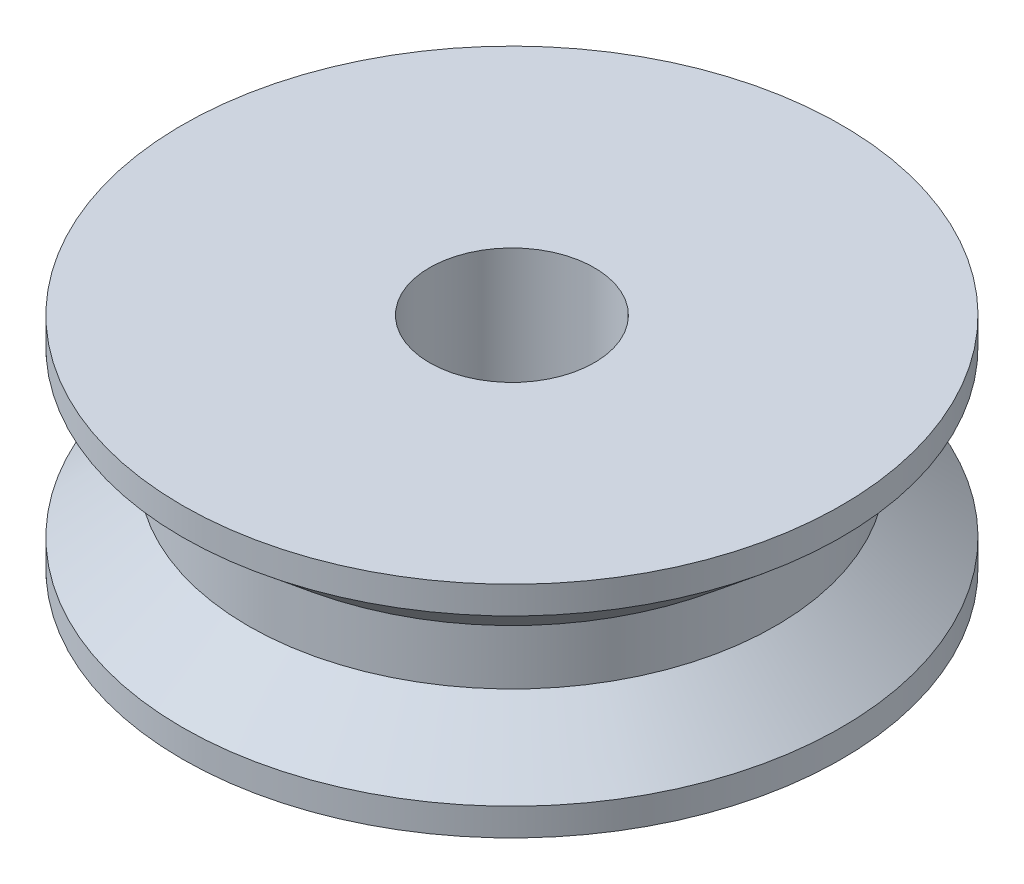
ISO-10303-21;
HEADER;
FILE_DESCRIPTION(('STEP AP214'),'2;1');
FILE_NAME('part.step','',(''),(''),'','','');
FILE_SCHEMA(('AUTOMOTIVE_DESIGN { 1 0 10303 214 1 1 1 1 }'));
ENDSEC;
DATA;
#1=APPLICATION_CONTEXT('core data for automotive mechanical design processes');
#2=APPLICATION_PROTOCOL_DEFINITION('international standard','automotive_design',2000,#1);
#3=PRODUCT_CONTEXT('',#1,'mechanical');
#4=PRODUCT('Part','Part','',(#3));
#5=PRODUCT_RELATED_PRODUCT_CATEGORY('part','',(#4));
#6=PRODUCT_DEFINITION_FORMATION('','',#4);
#7=PRODUCT_DEFINITION_CONTEXT('part definition',#1,'design');
#8=PRODUCT_DEFINITION('design','',#6,#7);
#9=PRODUCT_DEFINITION_SHAPE('','',#8);
#10=(LENGTH_UNIT() NAMED_UNIT(*) SI_UNIT(.MILLI.,.METRE.));
#11=(NAMED_UNIT(*) PLANE_ANGLE_UNIT() SI_UNIT($,.RADIAN.));
#12=(NAMED_UNIT(*) SI_UNIT($,.STERADIAN.) SOLID_ANGLE_UNIT());
#13=UNCERTAINTY_MEASURE_WITH_UNIT(LENGTH_MEASURE(1.E-05),#10,'distance_accuracy_value','');
#14=(GEOMETRIC_REPRESENTATION_CONTEXT(3) GLOBAL_UNCERTAINTY_ASSIGNED_CONTEXT((#13)) GLOBAL_UNIT_ASSIGNED_CONTEXT((#10,
#11,#12)) REPRESENTATION_CONTEXT('',''));
#15=CARTESIAN_POINT('',(0.,0.,0.));
#16=DIRECTION('',(0.,0.,1.));
#17=DIRECTION('',(1.,0.,0.));
#18=AXIS2_PLACEMENT_3D('',#15,#16,#17);
#19=CARTESIAN_POINT('',(0.,4.,0.));
#20=DIRECTION('',(0.,-1.,0.));
#21=DIRECTION('',(0.,0.,-1.));
#22=AXIS2_PLACEMENT_3D('',#19,#20,#21);
#23=CYLINDRICAL_SURFACE('',#22,6.);
#24=CARTESIAN_POINT('',(0.,4.,0.));
#25=DIRECTION('',(0.,1.,0.));
#26=DIRECTION('',(0.,0.,1.));
#27=AXIS2_PLACEMENT_3D('',#24,#25,#26);
#28=CIRCLE('',#27,6.);
#29=CARTESIAN_POINT('',(0.,4.,6.));
#30=VERTEX_POINT('',#29);
#31=EDGE_CURVE('E10',#30,#30,#28,.T.);
#32=ORIENTED_EDGE('',*,*,#31,.F.);
#33=EDGE_LOOP('',(#32));
#34=FACE_BOUND('',#33,.T.);
#35=CARTESIAN_POINT('',(0.,3.5,0.));
#36=DIRECTION('',(0.,1.,0.));
#37=DIRECTION('',(0.,0.,1.));
#38=AXIS2_PLACEMENT_3D('',#35,#36,#37);
#39=CIRCLE('',#38,6.);
#40=CARTESIAN_POINT('',(0.,3.5,6.));
#41=VERTEX_POINT('',#40);
#42=EDGE_CURVE('E47',#41,#41,#39,.T.);
#43=ORIENTED_EDGE('',*,*,#42,.T.);
#44=EDGE_LOOP('',(#43));
#45=FACE_BOUND('',#44,.T.);
#46=ADVANCED_FACE('F32',(#34,#45),#23,.T.);
#47=CARTESIAN_POINT('',(0.,0.,0.));
#48=DIRECTION('',(0.,1.,0.));
#49=DIRECTION('',(0.,0.,1.));
#50=AXIS2_PLACEMENT_3D('',#47,#48,#49);
#51=CIRCLE('',#50,6.);
#52=CARTESIAN_POINT('',(0.,0.,6.));
#53=VERTEX_POINT('',#52);
#54=EDGE_CURVE('E35',#53,#53,#51,.T.);
#55=ORIENTED_EDGE('',*,*,#54,.T.);
#56=EDGE_LOOP('',(#55));
#57=FACE_BOUND('',#56,.T.);
#58=CARTESIAN_POINT('',(0.,0.5,0.));
#59=DIRECTION('',(0.,1.,0.));
#60=DIRECTION('',(0.,0.,1.));
#61=AXIS2_PLACEMENT_3D('',#58,#59,#60);
#62=CIRCLE('',#61,6.);
#63=CARTESIAN_POINT('',(0.,0.5,6.));
#64=VERTEX_POINT('',#63);
#65=EDGE_CURVE('E52',#64,#64,#62,.T.);
#66=ORIENTED_EDGE('',*,*,#65,.F.);
#67=EDGE_LOOP('',(#66));
#68=FACE_BOUND('',#67,.T.);
#69=ADVANCED_FACE('F76',(#57,#68),#23,.T.);
#70=CARTESIAN_POINT('',(0.,4.,0.));
#71=DIRECTION('',(0.,1.,0.));
#72=DIRECTION('',(0.,0.,1.));
#73=AXIS2_PLACEMENT_3D('',#70,#71,#72);
#74=PLANE('',#73);
#75=ORIENTED_EDGE('',*,*,#31,.T.);
#76=EDGE_LOOP('',(#75));
#77=FACE_BOUND('',#76,.T.);
#78=CARTESIAN_POINT('',(0.,4.,0.));
#79=DIRECTION('',(0.,1.,0.));
#80=DIRECTION('',(0.,0.,1.));
#81=AXIS2_PLACEMENT_3D('',#78,#79,#80);
#82=CIRCLE('',#81,1.5);
#83=CARTESIAN_POINT('',(0.,4.,1.5));
#84=VERTEX_POINT('',#83);
#85=EDGE_CURVE('E42',#84,#84,#82,.T.);
#86=ORIENTED_EDGE('',*,*,#85,.F.);
#87=EDGE_LOOP('',(#86));
#88=FACE_BOUND('',#87,.T.);
#89=ADVANCED_FACE('F81',(#77,#88),#74,.T.);
#90=CARTESIAN_POINT('',(0.,0.,0.));
#91=DIRECTION('',(0.,1.,0.));
#92=DIRECTION('',(0.,0.,1.));
#93=AXIS2_PLACEMENT_3D('',#90,#91,#92);
#94=PLANE('',#93);
#95=ORIENTED_EDGE('',*,*,#54,.F.);
#96=EDGE_LOOP('',(#95));
#97=FACE_BOUND('',#96,.T.);
#98=CARTESIAN_POINT('',(0.,0.,0.));
#99=DIRECTION('',(0.,1.,0.));
#100=DIRECTION('',(0.,0.,1.));
#101=AXIS2_PLACEMENT_3D('',#98,#99,#100);
#102=CIRCLE('',#101,1.5);
#103=CARTESIAN_POINT('',(0.,0.,1.5));
#104=VERTEX_POINT('',#103);
#105=EDGE_CURVE('E44',#104,#104,#102,.T.);
#106=ORIENTED_EDGE('',*,*,#105,.T.);
#107=EDGE_LOOP('',(#106));
#108=FACE_BOUND('',#107,.T.);
#109=ADVANCED_FACE('F91',(#97,#108),#94,.F.);
#110=CARTESIAN_POINT('',(0.,4.,0.));
#111=DIRECTION('',(0.,-1.,0.));
#112=DIRECTION('',(0.,0.,-1.));
#113=AXIS2_PLACEMENT_3D('',#110,#111,#112);
#114=CYLINDRICAL_SURFACE('',#113,1.5);
#115=ORIENTED_EDGE('',*,*,#85,.T.);
#116=EDGE_LOOP('',(#115));
#117=FACE_BOUND('',#116,.T.);
#118=ORIENTED_EDGE('',*,*,#105,.F.);
#119=EDGE_LOOP('',(#118));
#120=FACE_BOUND('',#119,.T.);
#121=ADVANCED_FACE('F86',(#117,#120),#114,.F.);
#122=CARTESIAN_POINT('',(0.,3.5,0.));
#123=DIRECTION('',(0.,1.,0.));
#124=DIRECTION('',(0.,0.,1.));
#125=AXIS2_PLACEMENT_3D('',#122,#123,#124);
#126=CONICAL_SURFACE('',#125,6.,0.876058050598193);
#127=CARTESIAN_POINT('',(0.,2.5,0.));
#128=DIRECTION('',(0.,1.,0.));
#129=DIRECTION('',(0.,0.,1.));
#130=AXIS2_PLACEMENT_3D('',#127,#128,#129);
#131=CIRCLE('',#130,4.8);
#132=CARTESIAN_POINT('',(0.,2.5,4.8));
#133=VERTEX_POINT('',#132);
#134=EDGE_CURVE('E58',#133,#133,#131,.T.);
#135=ORIENTED_EDGE('',*,*,#134,.T.);
#136=EDGE_LOOP('',(#135));
#137=FACE_BOUND('',#136,.T.);
#138=ORIENTED_EDGE('',*,*,#42,.F.);
#139=EDGE_LOOP('',(#138));
#140=FACE_BOUND('',#139,.T.);
#141=ADVANCED_FACE('F62',(#137,#140),#126,.T.);
#142=CARTESIAN_POINT('',(0.,1.5,0.));
#143=DIRECTION('',(0.,-1.,0.));
#144=DIRECTION('',(0.,0.,-1.));
#145=AXIS2_PLACEMENT_3D('',#142,#143,#144);
#146=CONICAL_SURFACE('',#145,4.8,0.876058050598193);
#147=ORIENTED_EDGE('',*,*,#65,.T.);
#148=EDGE_LOOP('',(#147));
#149=FACE_BOUND('',#148,.T.);
#150=CARTESIAN_POINT('',(0.,1.5,0.));
#151=DIRECTION('',(0.,1.,0.));
#152=DIRECTION('',(0.,0.,1.));
#153=AXIS2_PLACEMENT_3D('',#150,#151,#152);
#154=CIRCLE('',#153,4.8);
#155=CARTESIAN_POINT('',(0.,1.5,4.8));
#156=VERTEX_POINT('',#155);
#157=EDGE_CURVE('E55',#156,#156,#154,.T.);
#158=ORIENTED_EDGE('',*,*,#157,.F.);
#159=EDGE_LOOP('',(#158));
#160=FACE_BOUND('',#159,.T.);
#161=ADVANCED_FACE('F67',(#149,#160),#146,.T.);
#162=CARTESIAN_POINT('',(0.,4.,0.));
#163=DIRECTION('',(0.,1.,0.));
#164=DIRECTION('',(0.,0.,1.));
#165=AXIS2_PLACEMENT_3D('',#162,#163,#164);
#166=CYLINDRICAL_SURFACE('',#165,4.8);
#167=ORIENTED_EDGE('',*,*,#157,.T.);
#168=EDGE_LOOP('',(#167));
#169=FACE_BOUND('',#168,.T.);
#170=ORIENTED_EDGE('',*,*,#134,.F.);
#171=EDGE_LOOP('',(#170));
#172=FACE_BOUND('',#171,.T.);
#173=ADVANCED_FACE('F65',(#169,#172),#166,.T.);
#174=CLOSED_SHELL('',(#46,#69,#89,#109,#121,#141,#161,#173));
#175=MANIFOLD_SOLID_BREP('B2',#174);
#176=ADVANCED_BREP_SHAPE_REPRESENTATION('',(#18,#175),#14);
#177=SHAPE_DEFINITION_REPRESENTATION(#9,#176);
ENDSEC;
END-ISO-10303-21;
